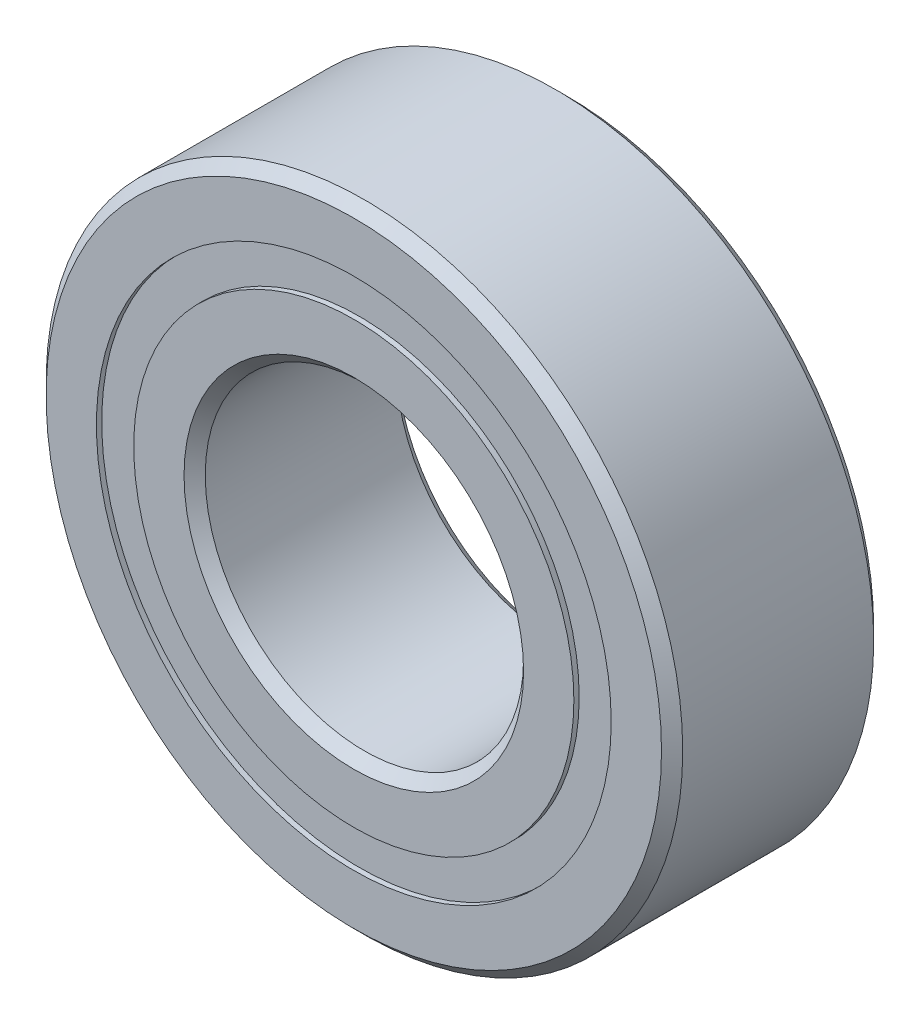
ISO-10303-21;
HEADER;
FILE_DESCRIPTION(('STEP AP214'),'2;1');
FILE_NAME('part.step','',(''),(''),'','','');
FILE_SCHEMA(('AUTOMOTIVE_DESIGN { 1 0 10303 214 1 1 1 1 }'));
ENDSEC;
DATA;
#1=APPLICATION_CONTEXT('core data for automotive mechanical design processes');
#2=APPLICATION_PROTOCOL_DEFINITION('international standard','automotive_design',2000,#1);
#3=PRODUCT_CONTEXT('',#1,'mechanical');
#4=PRODUCT('Part','Part','',(#3));
#5=PRODUCT_RELATED_PRODUCT_CATEGORY('part','',(#4));
#6=PRODUCT_DEFINITION_FORMATION('','',#4);
#7=PRODUCT_DEFINITION_CONTEXT('part definition',#1,'design');
#8=PRODUCT_DEFINITION('design','',#6,#7);
#9=PRODUCT_DEFINITION_SHAPE('','',#8);
#10=(LENGTH_UNIT() NAMED_UNIT(*) SI_UNIT(.MILLI.,.METRE.));
#11=(NAMED_UNIT(*) PLANE_ANGLE_UNIT() SI_UNIT($,.RADIAN.));
#12=(NAMED_UNIT(*) SI_UNIT($,.STERADIAN.) SOLID_ANGLE_UNIT());
#13=UNCERTAINTY_MEASURE_WITH_UNIT(LENGTH_MEASURE(1.E-05),#10,'distance_accuracy_value','');
#14=(GEOMETRIC_REPRESENTATION_CONTEXT(3) GLOBAL_UNCERTAINTY_ASSIGNED_CONTEXT((#13)) GLOBAL_UNIT_ASSIGNED_CONTEXT((#10,
#11,#12)) REPRESENTATION_CONTEXT('',''));
#15=CARTESIAN_POINT('',(0.,0.,0.));
#16=DIRECTION('',(0.,0.,1.));
#17=DIRECTION('',(1.,0.,0.));
#18=AXIS2_PLACEMENT_3D('',#15,#16,#17);
#19=CARTESIAN_POINT('',(0.,4.85164835164835,-1.9));
#20=DIRECTION('',(0.,0.,1.));
#21=DIRECTION('',(1.,0.,0.));
#22=AXIS2_PLACEMENT_3D('',#19,#20,#21);
#23=PLANE('',#22);
#24=CARTESIAN_POINT('',(0.,0.,-1.9));
#25=DIRECTION('',(0.,0.,1.));
#26=DIRECTION('',(1.,0.,0.));
#27=AXIS2_PLACEMENT_3D('',#24,#25,#26);
#28=CIRCLE('',#27,4.85164835164835);
#29=CARTESIAN_POINT('',(4.85164835164835,0.,-1.9));
#30=VERTEX_POINT('',#29);
#31=EDGE_CURVE('E57',#30,#30,#28,.T.);
#32=ORIENTED_EDGE('',*,*,#31,.F.);
#33=EDGE_LOOP('',(#32));
#34=FACE_BOUND('',#33,.T.);
#35=CARTESIAN_POINT('',(0.,0.,-1.9));
#36=DIRECTION('',(0.,0.,1.));
#37=DIRECTION('',(1.,0.,0.));
#38=AXIS2_PLACEMENT_3D('',#35,#36,#37);
#39=CIRCLE('',#38,4.14835164835165);
#40=CARTESIAN_POINT('',(4.14835164835165,0.,-1.9));
#41=VERTEX_POINT('',#40);
#42=EDGE_CURVE('E11',#41,#41,#39,.T.);
#43=ORIENTED_EDGE('',*,*,#42,.T.);
#44=EDGE_LOOP('',(#43));
#45=FACE_BOUND('',#44,.T.);
#46=ADVANCED_FACE('F43',(#34,#45),#23,.F.);
#47=CARTESIAN_POINT('',(0.,0.,2.));
#48=DIRECTION('',(0.,0.,1.));
#49=DIRECTION('',(1.,0.,0.));
#50=AXIS2_PLACEMENT_3D('',#47,#48,#49);
#51=CYLINDRICAL_SURFACE('',#50,4.14835164835165);
#52=ORIENTED_EDGE('',*,*,#42,.F.);
#53=EDGE_LOOP('',(#52));
#54=FACE_BOUND('',#53,.T.);
#55=CARTESIAN_POINT('',(0.,0.,-0.955918417024762));
#56=DIRECTION('',(0.,0.,1.));
#57=DIRECTION('',(1.,0.,0.));
#58=AXIS2_PLACEMENT_3D('',#55,#56,#57);
#59=CIRCLE('',#58,4.14835164835165);
#60=CARTESIAN_POINT('',(4.14835164835165,0.,-0.955918417024762));
#61=VERTEX_POINT('',#60);
#62=EDGE_CURVE('E49',#61,#61,#59,.T.);
#63=ORIENTED_EDGE('',*,*,#62,.T.);
#64=EDGE_LOOP('',(#63));
#65=FACE_BOUND('',#64,.T.);
#66=ADVANCED_FACE('F66',(#54,#65),#51,.F.);
#67=CARTESIAN_POINT('',(0.,4.85164835164835,-0.955918417024762));
#68=DIRECTION('',(0.,0.,-1.));
#69=DIRECTION('',(-1.,0.,0.));
#70=AXIS2_PLACEMENT_3D('',#67,#68,#69);
#71=PLANE('',#70);
#72=ORIENTED_EDGE('',*,*,#62,.F.);
#73=EDGE_LOOP('',(#72));
#74=FACE_BOUND('',#73,.T.);
#75=CARTESIAN_POINT('',(0.,0.,-0.955918417024762));
#76=DIRECTION('',(0.,0.,1.));
#77=DIRECTION('',(1.,0.,0.));
#78=AXIS2_PLACEMENT_3D('',#75,#76,#77);
#79=CIRCLE('',#78,4.85164835164835);
#80=CARTESIAN_POINT('',(4.85164835164835,0.,-0.955918417024762));
#81=VERTEX_POINT('',#80);
#82=EDGE_CURVE('E53',#81,#81,#79,.T.);
#83=ORIENTED_EDGE('',*,*,#82,.T.);
#84=EDGE_LOOP('',(#83));
#85=FACE_BOUND('',#84,.T.);
#86=ADVANCED_FACE('F70',(#74,#85),#71,.F.);
#87=CARTESIAN_POINT('',(0.,0.,2.));
#88=DIRECTION('',(0.,0.,1.));
#89=DIRECTION('',(1.,0.,0.));
#90=AXIS2_PLACEMENT_3D('',#87,#88,#89);
#91=CYLINDRICAL_SURFACE('',#90,4.85164835164835);
#92=ORIENTED_EDGE('',*,*,#82,.F.);
#93=EDGE_LOOP('',(#92));
#94=FACE_BOUND('',#93,.T.);
#95=ORIENTED_EDGE('',*,*,#31,.T.);
#96=EDGE_LOOP('',(#95));
#97=FACE_BOUND('',#96,.T.);
#98=ADVANCED_FACE('F63',(#94,#97),#91,.T.);
#99=CLOSED_SHELL('',(#46,#66,#86,#98));
#100=MANIFOLD_SOLID_BREP('B2',#99);
#101=CARTESIAN_POINT('',(0.,4.85164835164835,1.9));
#102=DIRECTION('',(0.,0.,-1.));
#103=DIRECTION('',(-1.,0.,0.));
#104=AXIS2_PLACEMENT_3D('',#101,#102,#103);
#105=PLANE('',#104);
#106=CARTESIAN_POINT('',(0.,0.,1.9));
#107=DIRECTION('',(0.,0.,1.));
#108=DIRECTION('',(1.,0.,0.));
#109=AXIS2_PLACEMENT_3D('',#106,#107,#108);
#110=CIRCLE('',#109,4.14835164835165);
#111=CARTESIAN_POINT('',(4.14835164835165,0.,1.9));
#112=VERTEX_POINT('',#111);
#113=EDGE_CURVE('E42',#112,#112,#110,.T.);
#114=ORIENTED_EDGE('',*,*,#113,.F.);
#115=EDGE_LOOP('',(#114));
#116=FACE_BOUND('',#115,.T.);
#117=CARTESIAN_POINT('',(0.,0.,1.9));
#118=DIRECTION('',(0.,0.,1.));
#119=DIRECTION('',(1.,0.,0.));
#120=AXIS2_PLACEMENT_3D('',#117,#118,#119);
#121=CIRCLE('',#120,4.85164835164835);
#122=CARTESIAN_POINT('',(4.85164835164835,0.,1.9));
#123=VERTEX_POINT('',#122);
#124=EDGE_CURVE('E124',#123,#123,#121,.T.);
#125=ORIENTED_EDGE('',*,*,#124,.T.);
#126=EDGE_LOOP('',(#125));
#127=FACE_BOUND('',#126,.T.);
#128=ADVANCED_FACE('F110',(#116,#127),#105,.F.);
#129=CARTESIAN_POINT('',(0.,0.,2.));
#130=DIRECTION('',(0.,0.,1.));
#131=DIRECTION('',(1.,0.,0.));
#132=AXIS2_PLACEMENT_3D('',#129,#130,#131);
#133=CYLINDRICAL_SURFACE('',#132,4.14835164835165);
#134=CARTESIAN_POINT('',(0.,0.,0.955918417024761));
#135=DIRECTION('',(0.,0.,1.));
#136=DIRECTION('',(1.,0.,0.));
#137=AXIS2_PLACEMENT_3D('',#134,#135,#136);
#138=CIRCLE('',#137,4.14835164835165);
#139=CARTESIAN_POINT('',(4.14835164835165,0.,0.955918417024761));
#140=VERTEX_POINT('',#139);
#141=EDGE_CURVE('E116',#140,#140,#138,.T.);
#142=ORIENTED_EDGE('',*,*,#141,.F.);
#143=EDGE_LOOP('',(#142));
#144=FACE_BOUND('',#143,.T.);
#145=ORIENTED_EDGE('',*,*,#113,.T.);
#146=EDGE_LOOP('',(#145));
#147=FACE_BOUND('',#146,.T.);
#148=ADVANCED_FACE('F139',(#144,#147),#133,.F.);
#149=CARTESIAN_POINT('',(0.,4.85164835164835,0.955918417024761));
#150=DIRECTION('',(0.,0.,1.));
#151=DIRECTION('',(1.,0.,0.));
#152=AXIS2_PLACEMENT_3D('',#149,#150,#151);
#153=PLANE('',#152);
#154=CARTESIAN_POINT('',(0.,0.,0.955918417024761));
#155=DIRECTION('',(0.,0.,1.));
#156=DIRECTION('',(1.,0.,0.));
#157=AXIS2_PLACEMENT_3D('',#154,#155,#156);
#158=CIRCLE('',#157,4.85164835164835);
#159=CARTESIAN_POINT('',(4.85164835164835,0.,0.955918417024761));
#160=VERTEX_POINT('',#159);
#161=EDGE_CURVE('E120',#160,#160,#158,.T.);
#162=ORIENTED_EDGE('',*,*,#161,.F.);
#163=EDGE_LOOP('',(#162));
#164=FACE_BOUND('',#163,.T.);
#165=ORIENTED_EDGE('',*,*,#141,.T.);
#166=EDGE_LOOP('',(#165));
#167=FACE_BOUND('',#166,.T.);
#168=ADVANCED_FACE('F134',(#164,#167),#153,.F.);
#169=CARTESIAN_POINT('',(0.,0.,2.));
#170=DIRECTION('',(0.,0.,1.));
#171=DIRECTION('',(1.,0.,0.));
#172=AXIS2_PLACEMENT_3D('',#169,#170,#171);
#173=CYLINDRICAL_SURFACE('',#172,4.85164835164835);
#174=ORIENTED_EDGE('',*,*,#124,.F.);
#175=EDGE_LOOP('',(#174));
#176=FACE_BOUND('',#175,.T.);
#177=ORIENTED_EDGE('',*,*,#161,.T.);
#178=EDGE_LOOP('',(#177));
#179=FACE_BOUND('',#178,.T.);
#180=ADVANCED_FACE('F131',(#176,#179),#173,.T.);
#181=CLOSED_SHELL('',(#128,#148,#168,#180));
#182=MANIFOLD_SOLID_BREP('B6',#181);
#183=CARTESIAN_POINT('',(-2.24999999999995,3.89711431703,0.));
#184=DIRECTION('',(0.,0.,1.));
#185=DIRECTION('',(-0.499999999999989,0.866025403784445,0.));
#186=AXIS2_PLACEMENT_3D('',#183,#184,#185);
#187=SPHERICAL_SURFACE('',#186,0.955918417024761);
#188=CARTESIAN_POINT('',(-2.24999999999995,3.89711431703,0.955918417024761));
#189=VERTEX_POINT('',#188);
#190=VERTEX_LOOP('',#189);
#191=FACE_BOUND('',#190,.T.);
#192=ADVANCED_FACE('F177',(#191),#187,.T.);
#193=CLOSED_SHELL('',(#192));
#194=MANIFOLD_SOLID_BREP('B37',#193);
#195=CARTESIAN_POINT('',(-3.89711431702995,2.25000000000005,0.));
#196=DIRECTION('',(0.,0.,1.));
#197=DIRECTION('',(-0.866025403784433,0.50000000000001,0.));
#198=AXIS2_PLACEMENT_3D('',#195,#196,#197);
#199=SPHERICAL_SURFACE('',#198,0.955918417024761);
#200=CARTESIAN_POINT('',(-3.89711431702995,2.25000000000005,0.955918417024761));
#201=VERTEX_POINT('',#200);
#202=VERTEX_LOOP('',#201);
#203=FACE_BOUND('',#202,.T.);
#204=ADVANCED_FACE('F197',(#203),#199,.T.);
#205=CLOSED_SHELL('',(#204));
#206=MANIFOLD_SOLID_BREP('B106',#205);
#207=CARTESIAN_POINT('',(-4.5,0.,0.));
#208=DIRECTION('',(0.,0.,1.));
#209=DIRECTION('',(-1.,0.,0.));
#210=AXIS2_PLACEMENT_3D('',#207,#208,#209);
#211=SPHERICAL_SURFACE('',#210,0.955918417024761);
#212=CARTESIAN_POINT('',(-4.5,0.,0.955918417024761));
#213=VERTEX_POINT('',#212);
#214=VERTEX_LOOP('',#213);
#215=FACE_BOUND('',#214,.T.);
#216=ADVANCED_FACE('F217',(#215),#211,.T.);
#217=CLOSED_SHELL('',(#216));
#218=MANIFOLD_SOLID_BREP('B173',#217);
#219=CARTESIAN_POINT('',(-3.89711431703,-2.24999999999996,0.));
#220=DIRECTION('',(0.,0.,1.));
#221=DIRECTION('',(-0.866025403784443,-0.499999999999992,0.));
#222=AXIS2_PLACEMENT_3D('',#219,#220,#221);
#223=SPHERICAL_SURFACE('',#222,0.955918417024761);
#224=CARTESIAN_POINT('',(-3.89711431703,-2.24999999999996,0.955918417024761));
#225=VERTEX_POINT('',#224);
#226=VERTEX_LOOP('',#225);
#227=FACE_BOUND('',#226,.T.);
#228=ADVANCED_FACE('F237',(#227),#223,.T.);
#229=CLOSED_SHELL('',(#228));
#230=MANIFOLD_SOLID_BREP('B193',#229);
#231=CARTESIAN_POINT('',(-2.25000000000003,-3.89711431702996,0.));
#232=DIRECTION('',(0.,0.,1.));
#233=DIRECTION('',(-0.500000000000007,-0.866025403784435,0.));
#234=AXIS2_PLACEMENT_3D('',#231,#232,#233);
#235=SPHERICAL_SURFACE('',#234,0.955918417024761);
#236=CARTESIAN_POINT('',(-2.25000000000003,-3.89711431702996,0.955918417024761));
#237=VERTEX_POINT('',#236);
#238=VERTEX_LOOP('',#237);
#239=FACE_BOUND('',#238,.T.);
#240=ADVANCED_FACE('F257',(#239),#235,.T.);
#241=CLOSED_SHELL('',(#240));
#242=MANIFOLD_SOLID_BREP('B213',#241);
#243=CARTESIAN_POINT('',(0.,-4.5,0.));
#244=DIRECTION('',(0.,0.,1.));
#245=DIRECTION('',(0.,-1.,0.));
#246=AXIS2_PLACEMENT_3D('',#243,#244,#245);
#247=SPHERICAL_SURFACE('',#246,0.955918417024761);
#248=CARTESIAN_POINT('',(0.,-4.5,0.955918417024761));
#249=VERTEX_POINT('',#248);
#250=VERTEX_LOOP('',#249);
#251=FACE_BOUND('',#250,.T.);
#252=ADVANCED_FACE('F277',(#251),#247,.T.);
#253=CLOSED_SHELL('',(#252));
#254=MANIFOLD_SOLID_BREP('B233',#253);
#255=CARTESIAN_POINT('',(2.24999999999998,-3.89711431702999,0.));
#256=DIRECTION('',(0.,0.,1.));
#257=DIRECTION('',(0.499999999999995,-0.866025403784442,0.));
#258=AXIS2_PLACEMENT_3D('',#255,#256,#257);
#259=SPHERICAL_SURFACE('',#258,0.955918417024761);
#260=CARTESIAN_POINT('',(2.24999999999998,-3.89711431702999,0.955918417024761));
#261=VERTEX_POINT('',#260);
#262=VERTEX_LOOP('',#261);
#263=FACE_BOUND('',#262,.T.);
#264=ADVANCED_FACE('F297',(#263),#259,.T.);
#265=CLOSED_SHELL('',(#264));
#266=MANIFOLD_SOLID_BREP('B253',#265);
#267=CARTESIAN_POINT('',(3.89711431702996,-2.25000000000002,0.));
#268=DIRECTION('',(0.,0.,1.));
#269=DIRECTION('',(0.866025403784436,-0.500000000000004,0.));
#270=AXIS2_PLACEMENT_3D('',#267,#268,#269);
#271=SPHERICAL_SURFACE('',#270,0.955918417024761);
#272=CARTESIAN_POINT('',(3.89711431702996,-2.25000000000002,0.955918417024761));
#273=VERTEX_POINT('',#272);
#274=VERTEX_LOOP('',#273);
#275=FACE_BOUND('',#274,.T.);
#276=ADVANCED_FACE('F317',(#275),#271,.T.);
#277=CLOSED_SHELL('',(#276));
#278=MANIFOLD_SOLID_BREP('B273',#277);
#279=CARTESIAN_POINT('',(4.5,0.,0.));
#280=DIRECTION('',(0.,0.,1.));
#281=DIRECTION('',(1.,0.,0.));
#282=AXIS2_PLACEMENT_3D('',#279,#280,#281);
#283=SPHERICAL_SURFACE('',#282,0.955918417024761);
#284=CARTESIAN_POINT('',(4.5,0.,0.955918417024761));
#285=VERTEX_POINT('',#284);
#286=VERTEX_LOOP('',#285);
#287=FACE_BOUND('',#286,.T.);
#288=ADVANCED_FACE('F337',(#287),#283,.T.);
#289=CLOSED_SHELL('',(#288));
#290=MANIFOLD_SOLID_BREP('B293',#289);
#291=CARTESIAN_POINT('',(3.89711431702998,2.24999999999999,0.));
#292=DIRECTION('',(0.,0.,1.));
#293=DIRECTION('',(0.86602540378444,0.499999999999998,0.));
#294=AXIS2_PLACEMENT_3D('',#291,#292,#293);
#295=SPHERICAL_SURFACE('',#294,0.955918417024761);
#296=CARTESIAN_POINT('',(3.89711431702998,2.24999999999999,0.955918417024761));
#297=VERTEX_POINT('',#296);
#298=VERTEX_LOOP('',#297);
#299=FACE_BOUND('',#298,.T.);
#300=ADVANCED_FACE('F357',(#299),#295,.T.);
#301=CLOSED_SHELL('',(#300));
#302=MANIFOLD_SOLID_BREP('B313',#301);
#303=CARTESIAN_POINT('',(2.25,3.89711431702997,0.));
#304=DIRECTION('',(0.,0.,1.));
#305=DIRECTION('',(0.500000000000001,0.866025403784438,0.));
#306=AXIS2_PLACEMENT_3D('',#303,#304,#305);
#307=SPHERICAL_SURFACE('',#306,0.955918417024761);
#308=CARTESIAN_POINT('',(2.25,3.89711431702997,0.955918417024761));
#309=VERTEX_POINT('',#308);
#310=VERTEX_LOOP('',#309);
#311=FACE_BOUND('',#310,.T.);
#312=ADVANCED_FACE('F377',(#311),#307,.T.);
#313=CLOSED_SHELL('',(#312));
#314=MANIFOLD_SOLID_BREP('B333',#313);
#315=CARTESIAN_POINT('',(0.,4.5,0.));
#316=DIRECTION('',(0.,0.,1.));
#317=DIRECTION('',(0.,1.,0.));
#318=AXIS2_PLACEMENT_3D('',#315,#316,#317);
#319=SPHERICAL_SURFACE('',#318,0.955918417024761);
#320=CARTESIAN_POINT('',(0.,4.5,0.955918417024761));
#321=VERTEX_POINT('',#320);
#322=VERTEX_LOOP('',#321);
#323=FACE_BOUND('',#322,.T.);
#324=ADVANCED_FACE('F399',(#323),#319,.T.);
#325=CLOSED_SHELL('',(#324));
#326=MANIFOLD_SOLID_BREP('B353',#325);
#327=CARTESIAN_POINT('',(0.,4.14835164835165,2.));
#328=DIRECTION('',(0.,0.,-1.));
#329=DIRECTION('',(-1.,0.,0.));
#330=AXIS2_PLACEMENT_3D('',#327,#328,#329);
#331=PLANE('',#330);
#332=CARTESIAN_POINT('',(0.,0.,2.));
#333=DIRECTION('',(0.,0.,1.));
#334=DIRECTION('',(1.,0.,0.));
#335=AXIS2_PLACEMENT_3D('',#332,#333,#334);
#336=CIRCLE('',#335,3.2);
#337=CARTESIAN_POINT('',(3.2,0.,2.));
#338=VERTEX_POINT('',#337);
#339=EDGE_CURVE('E446',#338,#338,#336,.T.);
#340=ORIENTED_EDGE('',*,*,#339,.F.);
#341=EDGE_LOOP('',(#340));
#342=FACE_BOUND('',#341,.T.);
#343=CARTESIAN_POINT('',(0.,0.,2.));
#344=DIRECTION('',(0.,0.,1.));
#345=DIRECTION('',(1.,0.,0.));
#346=AXIS2_PLACEMENT_3D('',#343,#344,#345);
#347=CIRCLE('',#346,4.14835164835165);
#348=CARTESIAN_POINT('',(4.14835164835165,0.,2.));
#349=VERTEX_POINT('',#348);
#350=EDGE_CURVE('E398',#349,#349,#347,.T.);
#351=ORIENTED_EDGE('',*,*,#350,.T.);
#352=EDGE_LOOP('',(#351));
#353=FACE_BOUND('',#352,.T.);
#354=ADVANCED_FACE('F418',(#342,#353),#331,.F.);
#355=CARTESIAN_POINT('',(0.,0.,2.));
#356=DIRECTION('',(0.,0.,1.));
#357=DIRECTION('',(1.,0.,0.));
#358=AXIS2_PLACEMENT_3D('',#355,#356,#357);
#359=CYLINDRICAL_SURFACE('',#358,4.14835164835165);
#360=ORIENTED_EDGE('',*,*,#350,.F.);
#361=EDGE_LOOP('',(#360));
#362=FACE_BOUND('',#361,.T.);
#363=CARTESIAN_POINT('',(0.,0.,0.888888888888889));
#364=DIRECTION('',(0.,0.,1.));
#365=DIRECTION('',(1.,0.,0.));
#366=AXIS2_PLACEMENT_3D('',#363,#364,#365);
#367=CIRCLE('',#366,4.14835164835165);
#368=CARTESIAN_POINT('',(4.14835164835165,0.,0.888888888888889));
#369=VERTEX_POINT('',#368);
#370=EDGE_CURVE('E424',#369,#369,#367,.T.);
#371=ORIENTED_EDGE('',*,*,#370,.T.);
#372=EDGE_LOOP('',(#371));
#373=FACE_BOUND('',#372,.T.);
#374=ADVANCED_FACE('F453',(#362,#373),#359,.T.);
#375=CARTESIAN_POINT('',(0.,0.,0.));
#376=DIRECTION('',(0.,0.,1.));
#377=DIRECTION('',(1.,0.,0.));
#378=AXIS2_PLACEMENT_3D('',#375,#376,#377);
#379=TOROIDAL_SURFACE('',#378,4.49999999999999,0.95591841702476);
#380=ORIENTED_EDGE('',*,*,#370,.F.);
#381=EDGE_LOOP('',(#380));
#382=FACE_BOUND('',#381,.T.);
#383=CARTESIAN_POINT('',(0.,0.,-0.88888888888889));
#384=DIRECTION('',(0.,0.,1.));
#385=DIRECTION('',(1.,0.,0.));
#386=AXIS2_PLACEMENT_3D('',#383,#384,#385);
#387=CIRCLE('',#386,4.14835164835165);
#388=CARTESIAN_POINT('',(4.14835164835165,0.,-0.88888888888889));
#389=VERTEX_POINT('',#388);
#390=EDGE_CURVE('E428',#389,#389,#387,.T.);
#391=ORIENTED_EDGE('',*,*,#390,.T.);
#392=EDGE_LOOP('',(#391));
#393=FACE_BOUND('',#392,.T.);
#394=ADVANCED_FACE('F457',(#382,#393),#379,.F.);
#395=CARTESIAN_POINT('',(0.,0.,2.));
#396=DIRECTION('',(0.,0.,1.));
#397=DIRECTION('',(1.,0.,0.));
#398=AXIS2_PLACEMENT_3D('',#395,#396,#397);
#399=CYLINDRICAL_SURFACE('',#398,4.14835164835165);
#400=ORIENTED_EDGE('',*,*,#390,.F.);
#401=EDGE_LOOP('',(#400));
#402=FACE_BOUND('',#401,.T.);
#403=CARTESIAN_POINT('',(0.,0.,-2.));
#404=DIRECTION('',(0.,0.,1.));
#405=DIRECTION('',(1.,0.,0.));
#406=AXIS2_PLACEMENT_3D('',#403,#404,#405);
#407=CIRCLE('',#406,4.14835164835165);
#408=CARTESIAN_POINT('',(4.14835164835165,0.,-2.));
#409=VERTEX_POINT('',#408);
#410=EDGE_CURVE('E432',#409,#409,#407,.T.);
#411=ORIENTED_EDGE('',*,*,#410,.T.);
#412=EDGE_LOOP('',(#411));
#413=FACE_BOUND('',#412,.T.);
#414=ADVANCED_FACE('F462',(#402,#413),#399,.T.);
#415=CARTESIAN_POINT('',(0.,3.2,-2.));
#416=DIRECTION('',(0.,0.,1.));
#417=DIRECTION('',(1.,0.,0.));
#418=AXIS2_PLACEMENT_3D('',#415,#416,#417);
#419=PLANE('',#418);
#420=ORIENTED_EDGE('',*,*,#410,.F.);
#421=EDGE_LOOP('',(#420));
#422=FACE_BOUND('',#421,.T.);
#423=CARTESIAN_POINT('',(0.,0.,-2.));
#424=DIRECTION('',(0.,0.,1.));
#425=DIRECTION('',(1.,0.,0.));
#426=AXIS2_PLACEMENT_3D('',#423,#424,#425);
#427=CIRCLE('',#426,3.2);
#428=CARTESIAN_POINT('',(3.2,0.,-2.));
#429=VERTEX_POINT('',#428);
#430=EDGE_CURVE('E437',#429,#429,#427,.T.);
#431=ORIENTED_EDGE('',*,*,#430,.T.);
#432=EDGE_LOOP('',(#431));
#433=FACE_BOUND('',#432,.T.);
#434=ADVANCED_FACE('F468',(#422,#433),#419,.F.);
#435=CARTESIAN_POINT('',(0.,0.,-1.8));
#436=DIRECTION('',(0.,0.,-1.));
#437=DIRECTION('',(-1.,0.,0.));
#438=AXIS2_PLACEMENT_3D('',#435,#436,#437);
#439=CONICAL_SURFACE('',#438,3.,0.785398163397454);
#440=ORIENTED_EDGE('',*,*,#430,.F.);
#441=EDGE_LOOP('',(#440));
#442=FACE_BOUND('',#441,.T.);
#443=CARTESIAN_POINT('',(0.,0.,-1.8));
#444=DIRECTION('',(0.,0.,1.));
#445=DIRECTION('',(1.,0.,0.));
#446=AXIS2_PLACEMENT_3D('',#443,#444,#445);
#447=CIRCLE('',#446,3.);
#448=CARTESIAN_POINT('',(3.,0.,-1.8));
#449=VERTEX_POINT('',#448);
#450=EDGE_CURVE('E440',#449,#449,#447,.T.);
#451=ORIENTED_EDGE('',*,*,#450,.T.);
#452=EDGE_LOOP('',(#451));
#453=FACE_BOUND('',#452,.T.);
#454=ADVANCED_FACE('F472',(#442,#453),#439,.F.);
#455=CARTESIAN_POINT('',(0.,0.,2.));
#456=DIRECTION('',(0.,0.,1.));
#457=DIRECTION('',(1.,0.,0.));
#458=AXIS2_PLACEMENT_3D('',#455,#456,#457);
#459=CYLINDRICAL_SURFACE('',#458,3.);
#460=ORIENTED_EDGE('',*,*,#450,.F.);
#461=EDGE_LOOP('',(#460));
#462=FACE_BOUND('',#461,.T.);
#463=CARTESIAN_POINT('',(0.,0.,1.8));
#464=DIRECTION('',(0.,0.,1.));
#465=DIRECTION('',(1.,0.,0.));
#466=AXIS2_PLACEMENT_3D('',#463,#464,#465);
#467=CIRCLE('',#466,3.);
#468=CARTESIAN_POINT('',(3.,0.,1.8));
#469=VERTEX_POINT('',#468);
#470=EDGE_CURVE('E443',#469,#469,#467,.T.);
#471=ORIENTED_EDGE('',*,*,#470,.T.);
#472=EDGE_LOOP('',(#471));
#473=FACE_BOUND('',#472,.T.);
#474=ADVANCED_FACE('F476',(#462,#473),#459,.F.);
#475=CARTESIAN_POINT('',(0.,0.,2.));
#476=DIRECTION('',(0.,0.,1.));
#477=DIRECTION('',(1.,0.,0.));
#478=AXIS2_PLACEMENT_3D('',#475,#476,#477);
#479=CONICAL_SURFACE('',#478,3.2,0.785398163397442);
#480=ORIENTED_EDGE('',*,*,#470,.F.);
#481=EDGE_LOOP('',(#480));
#482=FACE_BOUND('',#481,.T.);
#483=ORIENTED_EDGE('',*,*,#339,.T.);
#484=EDGE_LOOP('',(#483));
#485=FACE_BOUND('',#484,.T.);
#486=ADVANCED_FACE('F450',(#482,#485),#479,.F.);
#487=CLOSED_SHELL('',(#354,#374,#394,#414,#434,#454,#474,#486));
#488=MANIFOLD_SOLID_BREP('B373',#487);
#489=CARTESIAN_POINT('',(0.,0.,1.8));
#490=DIRECTION('',(0.,0.,-1.));
#491=DIRECTION('',(-1.,0.,0.));
#492=AXIS2_PLACEMENT_3D('',#489,#490,#491);
#493=CONICAL_SURFACE('',#492,6.,0.78539816339745);
#494=CARTESIAN_POINT('',(0.,0.,2.));
#495=DIRECTION('',(0.,0.,1.));
#496=DIRECTION('',(1.,0.,0.));
#497=AXIS2_PLACEMENT_3D('',#494,#495,#496);
#498=CIRCLE('',#497,5.8);
#499=CARTESIAN_POINT('',(5.8,0.,2.));
#500=VERTEX_POINT('',#499);
#501=EDGE_CURVE('E567',#500,#500,#498,.T.);
#502=ORIENTED_EDGE('',*,*,#501,.F.);
#503=EDGE_LOOP('',(#502));
#504=FACE_BOUND('',#503,.T.);
#505=CARTESIAN_POINT('',(0.,0.,1.8));
#506=DIRECTION('',(0.,0.,1.));
#507=DIRECTION('',(1.,0.,0.));
#508=AXIS2_PLACEMENT_3D('',#505,#506,#507);
#509=CIRCLE('',#508,6.);
#510=CARTESIAN_POINT('',(6.,0.,1.8));
#511=VERTEX_POINT('',#510);
#512=EDGE_CURVE('E417',#511,#511,#509,.T.);
#513=ORIENTED_EDGE('',*,*,#512,.T.);
#514=EDGE_LOOP('',(#513));
#515=FACE_BOUND('',#514,.T.);
#516=ADVANCED_FACE('F539',(#504,#515),#493,.T.);
#517=CARTESIAN_POINT('',(0.,0.,2.));
#518=DIRECTION('',(0.,0.,1.));
#519=DIRECTION('',(1.,0.,0.));
#520=AXIS2_PLACEMENT_3D('',#517,#518,#519);
#521=CYLINDRICAL_SURFACE('',#520,6.);
#522=ORIENTED_EDGE('',*,*,#512,.F.);
#523=EDGE_LOOP('',(#522));
#524=FACE_BOUND('',#523,.T.);
#525=CARTESIAN_POINT('',(0.,0.,-1.8));
#526=DIRECTION('',(0.,0.,1.));
#527=DIRECTION('',(1.,0.,0.));
#528=AXIS2_PLACEMENT_3D('',#525,#526,#527);
#529=CIRCLE('',#528,6.);
#530=CARTESIAN_POINT('',(6.,0.,-1.8));
#531=VERTEX_POINT('',#530);
#532=EDGE_CURVE('E545',#531,#531,#529,.T.);
#533=ORIENTED_EDGE('',*,*,#532,.T.);
#534=EDGE_LOOP('',(#533));
#535=FACE_BOUND('',#534,.T.);
#536=ADVANCED_FACE('F574',(#524,#535),#521,.T.);
#537=CARTESIAN_POINT('',(0.,0.,-2.));
#538=DIRECTION('',(0.,0.,1.));
#539=DIRECTION('',(1.,0.,0.));
#540=AXIS2_PLACEMENT_3D('',#537,#538,#539);
#541=CONICAL_SURFACE('',#540,5.8,0.78539816339745);
#542=ORIENTED_EDGE('',*,*,#532,.F.);
#543=EDGE_LOOP('',(#542));
#544=FACE_BOUND('',#543,.T.);
#545=CARTESIAN_POINT('',(0.,0.,-2.));
#546=DIRECTION('',(0.,0.,1.));
#547=DIRECTION('',(1.,0.,0.));
#548=AXIS2_PLACEMENT_3D('',#545,#546,#547);
#549=CIRCLE('',#548,5.8);
#550=CARTESIAN_POINT('',(5.8,0.,-2.));
#551=VERTEX_POINT('',#550);
#552=EDGE_CURVE('E549',#551,#551,#549,.T.);
#553=ORIENTED_EDGE('',*,*,#552,.T.);
#554=EDGE_LOOP('',(#553));
#555=FACE_BOUND('',#554,.T.);
#556=ADVANCED_FACE('F578',(#544,#555),#541,.T.);
#557=CARTESIAN_POINT('',(0.,5.8,-2.));
#558=DIRECTION('',(0.,0.,1.));
#559=DIRECTION('',(1.,0.,0.));
#560=AXIS2_PLACEMENT_3D('',#557,#558,#559);
#561=PLANE('',#560);
#562=ORIENTED_EDGE('',*,*,#552,.F.);
#563=EDGE_LOOP('',(#562));
#564=FACE_BOUND('',#563,.T.);
#565=CARTESIAN_POINT('',(0.,0.,-2.));
#566=DIRECTION('',(0.,0.,1.));
#567=DIRECTION('',(1.,0.,0.));
#568=AXIS2_PLACEMENT_3D('',#565,#566,#567);
#569=CIRCLE('',#568,4.85164835164835);
#570=CARTESIAN_POINT('',(4.85164835164835,0.,-2.));
#571=VERTEX_POINT('',#570);
#572=EDGE_CURVE('E553',#571,#571,#569,.T.);
#573=ORIENTED_EDGE('',*,*,#572,.T.);
#574=EDGE_LOOP('',(#573));
#575=FACE_BOUND('',#574,.T.);
#576=ADVANCED_FACE('F583',(#564,#575),#561,.F.);
#577=CARTESIAN_POINT('',(0.,0.,2.));
#578=DIRECTION('',(0.,0.,1.));
#579=DIRECTION('',(1.,0.,0.));
#580=AXIS2_PLACEMENT_3D('',#577,#578,#579);
#581=CYLINDRICAL_SURFACE('',#580,4.85164835164835);
#582=ORIENTED_EDGE('',*,*,#572,.F.);
#583=EDGE_LOOP('',(#582));
#584=FACE_BOUND('',#583,.T.);
#585=CARTESIAN_POINT('',(0.,0.,-0.888888888888889));
#586=DIRECTION('',(0.,0.,1.));
#587=DIRECTION('',(1.,0.,0.));
#588=AXIS2_PLACEMENT_3D('',#585,#586,#587);
#589=CIRCLE('',#588,4.85164835164835);
#590=CARTESIAN_POINT('',(4.85164835164835,0.,-0.888888888888889));
#591=VERTEX_POINT('',#590);
#592=EDGE_CURVE('E558',#591,#591,#589,.T.);
#593=ORIENTED_EDGE('',*,*,#592,.T.);
#594=EDGE_LOOP('',(#593));
#595=FACE_BOUND('',#594,.T.);
#596=ADVANCED_FACE('F589',(#584,#595),#581,.F.);
#597=CARTESIAN_POINT('',(0.,0.,0.));
#598=DIRECTION('',(0.,0.,1.));
#599=DIRECTION('',(1.,0.,0.));
#600=AXIS2_PLACEMENT_3D('',#597,#598,#599);
#601=TOROIDAL_SURFACE('',#600,4.5,0.955918417024761);
#602=ORIENTED_EDGE('',*,*,#592,.F.);
#603=EDGE_LOOP('',(#602));
#604=FACE_BOUND('',#603,.T.);
#605=CARTESIAN_POINT('',(0.,0.,0.888888888888889));
#606=DIRECTION('',(0.,0.,1.));
#607=DIRECTION('',(1.,0.,0.));
#608=AXIS2_PLACEMENT_3D('',#605,#606,#607);
#609=CIRCLE('',#608,4.85164835164835);
#610=CARTESIAN_POINT('',(4.85164835164835,0.,0.888888888888889));
#611=VERTEX_POINT('',#610);
#612=EDGE_CURVE('E561',#611,#611,#609,.T.);
#613=ORIENTED_EDGE('',*,*,#612,.T.);
#614=EDGE_LOOP('',(#613));
#615=FACE_BOUND('',#614,.T.);
#616=ADVANCED_FACE('F593',(#604,#615),#601,.F.);
#617=CARTESIAN_POINT('',(0.,0.,2.));
#618=DIRECTION('',(0.,0.,1.));
#619=DIRECTION('',(1.,0.,0.));
#620=AXIS2_PLACEMENT_3D('',#617,#618,#619);
#621=CYLINDRICAL_SURFACE('',#620,4.85164835164835);
#622=ORIENTED_EDGE('',*,*,#612,.F.);
#623=EDGE_LOOP('',(#622));
#624=FACE_BOUND('',#623,.T.);
#625=CARTESIAN_POINT('',(0.,0.,2.));
#626=DIRECTION('',(0.,0.,1.));
#627=DIRECTION('',(1.,0.,0.));
#628=AXIS2_PLACEMENT_3D('',#625,#626,#627);
#629=CIRCLE('',#628,4.85164835164835);
#630=CARTESIAN_POINT('',(4.85164835164835,0.,2.));
#631=VERTEX_POINT('',#630);
#632=EDGE_CURVE('E564',#631,#631,#629,.T.);
#633=ORIENTED_EDGE('',*,*,#632,.T.);
#634=EDGE_LOOP('',(#633));
#635=FACE_BOUND('',#634,.T.);
#636=ADVANCED_FACE('F597',(#624,#635),#621,.F.);
#637=CARTESIAN_POINT('',(0.,5.8,2.));
#638=DIRECTION('',(0.,0.,-1.));
#639=DIRECTION('',(-1.,0.,0.));
#640=AXIS2_PLACEMENT_3D('',#637,#638,#639);
#641=PLANE('',#640);
#642=ORIENTED_EDGE('',*,*,#632,.F.);
#643=EDGE_LOOP('',(#642));
#644=FACE_BOUND('',#643,.T.);
#645=ORIENTED_EDGE('',*,*,#501,.T.);
#646=EDGE_LOOP('',(#645));
#647=FACE_BOUND('',#646,.T.);
#648=ADVANCED_FACE('F571',(#644,#647),#641,.F.);
#649=CLOSED_SHELL('',(#516,#536,#556,#576,#596,#616,#636,#648));
#650=MANIFOLD_SOLID_BREP('B393',#649);
#651=ADVANCED_BREP_SHAPE_REPRESENTATION('',(#18,#100,#182,#194,#206,#218,#230,#242,#254,#266,
#278,#290,#302,#314,#326,#488,#650),#14);
#652=SHAPE_DEFINITION_REPRESENTATION(#9,#651);
ENDSEC;
END-ISO-10303-21;
